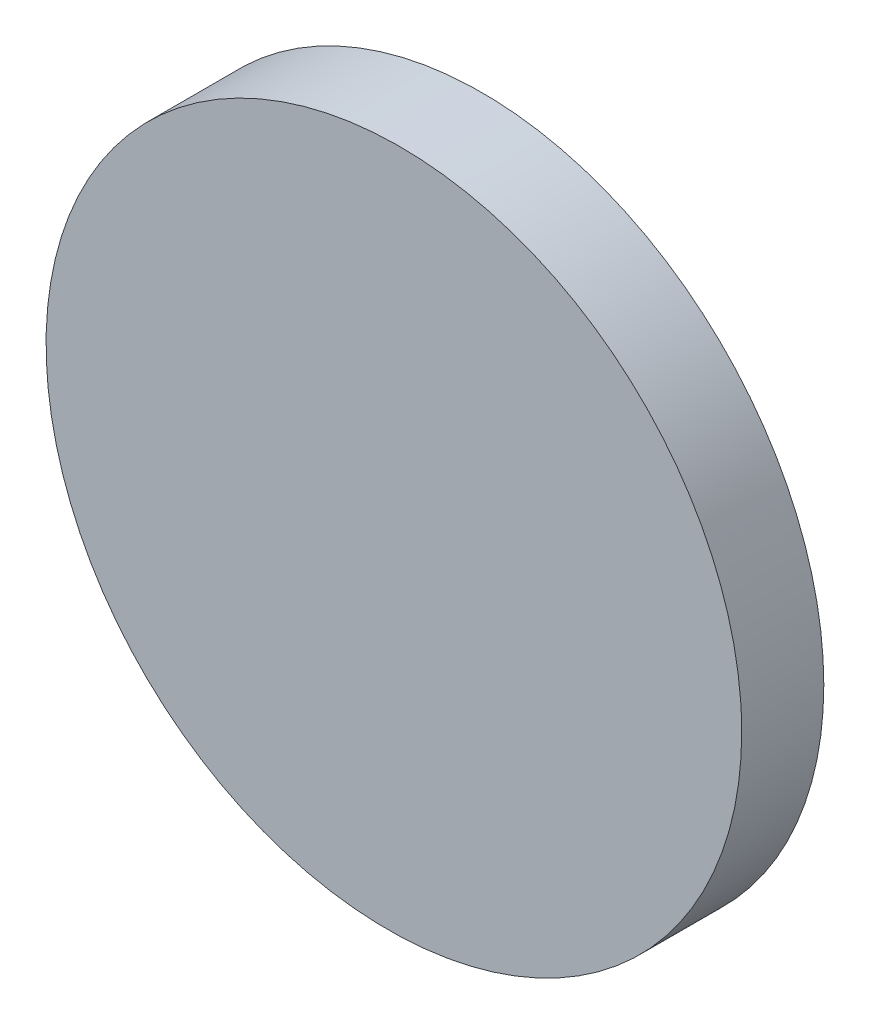
ISO-10303-21;
HEADER;
FILE_DESCRIPTION(('STEP AP214'),'2;1');
FILE_NAME('part.step','',(''),(''),'','','');
FILE_SCHEMA(('AUTOMOTIVE_DESIGN { 1 0 10303 214 1 1 1 1 }'));
ENDSEC;
DATA;
#1=APPLICATION_CONTEXT('core data for automotive mechanical design processes');
#2=APPLICATION_PROTOCOL_DEFINITION('international standard','automotive_design',2000,#1);
#3=PRODUCT_CONTEXT('',#1,'mechanical');
#4=PRODUCT('Part','Part','',(#3));
#5=PRODUCT_RELATED_PRODUCT_CATEGORY('part','',(#4));
#6=PRODUCT_DEFINITION_FORMATION('','',#4);
#7=PRODUCT_DEFINITION_CONTEXT('part definition',#1,'design');
#8=PRODUCT_DEFINITION('design','',#6,#7);
#9=PRODUCT_DEFINITION_SHAPE('','',#8);
#10=(LENGTH_UNIT() NAMED_UNIT(*) SI_UNIT(.MILLI.,.METRE.));
#11=(NAMED_UNIT(*) PLANE_ANGLE_UNIT() SI_UNIT($,.RADIAN.));
#12=(NAMED_UNIT(*) SI_UNIT($,.STERADIAN.) SOLID_ANGLE_UNIT());
#13=UNCERTAINTY_MEASURE_WITH_UNIT(LENGTH_MEASURE(1.E-05),#10,'distance_accuracy_value','');
#14=(GEOMETRIC_REPRESENTATION_CONTEXT(3) GLOBAL_UNCERTAINTY_ASSIGNED_CONTEXT((#13)) GLOBAL_UNIT_ASSIGNED_CONTEXT((#10,
#11,#12)) REPRESENTATION_CONTEXT('',''));
#15=CARTESIAN_POINT('',(0.,0.,0.));
#16=DIRECTION('',(0.,0.,1.));
#17=DIRECTION('',(1.,0.,0.));
#18=AXIS2_PLACEMENT_3D('',#15,#16,#17);
#19=CARTESIAN_POINT('',(0.,0.,10.));
#20=DIRECTION('',(0.,0.,-1.));
#21=DIRECTION('',(-1.,0.,0.));
#22=AXIS2_PLACEMENT_3D('',#19,#20,#21);
#23=CYLINDRICAL_SURFACE('',#22,12.5);
#24=CARTESIAN_POINT('',(0.,0.,3.2116413920234));
#25=DIRECTION('',(-0.0169288850398978,0.,-0.999856696157657));
#26=DIRECTION('',(0.999856696157657,0.,-0.0169288850398978));
#27=AXIS2_PLACEMENT_3D('',#24,#25,#26);
#28=ELLIPSE('',#27,12.501791554766,12.5);
#29=CARTESIAN_POINT('',(12.5,0.,3.));
#30=VERTEX_POINT('',#29);
#31=EDGE_CURVE('E36',#30,#30,#28,.T.);
#32=ORIENTED_EDGE('',*,*,#31,.T.);
#33=EDGE_LOOP('',(#32));
#34=FACE_BOUND('',#33,.T.);
#35=CARTESIAN_POINT('',(0.,0.,0.));
#36=DIRECTION('',(0.,0.,1.));
#37=DIRECTION('',(1.,0.,0.));
#38=AXIS2_PLACEMENT_3D('',#35,#36,#37);
#39=CIRCLE('',#38,12.5);
#40=CARTESIAN_POINT('',(12.5,0.,0.));
#41=VERTEX_POINT('',#40);
#42=EDGE_CURVE('E10',#41,#41,#39,.T.);
#43=ORIENTED_EDGE('',*,*,#42,.T.);
#44=EDGE_LOOP('',(#43));
#45=FACE_BOUND('',#44,.T.);
#46=ADVANCED_FACE('F33',(#34,#45),#23,.T.);
#47=CARTESIAN_POINT('',(0.,0.,0.));
#48=DIRECTION('',(0.,0.,1.));
#49=DIRECTION('',(1.,0.,0.));
#50=AXIS2_PLACEMENT_3D('',#47,#48,#49);
#51=PLANE('',#50);
#52=ORIENTED_EDGE('',*,*,#42,.F.);
#53=EDGE_LOOP('',(#52));
#54=FACE_BOUND('',#53,.T.);
#55=ADVANCED_FACE('F48',(#54),#51,.F.);
#56=CARTESIAN_POINT('',(12.5,-25.,3.));
#57=DIRECTION('',(-0.0169288850398978,0.,-0.999856696157657));
#58=DIRECTION('',(-0.999856696157657,0.,0.0169288850398978));
#59=AXIS2_PLACEMENT_3D('',#56,#57,#58);
#60=PLANE('',#59);
#61=ORIENTED_EDGE('',*,*,#31,.F.);
#62=EDGE_LOOP('',(#61));
#63=FACE_BOUND('',#62,.T.);
#64=ADVANCED_FACE('F46',(#63),#60,.F.);
#65=CLOSED_SHELL('',(#46,#55,#64));
#66=MANIFOLD_SOLID_BREP('B2',#65);
#67=ADVANCED_BREP_SHAPE_REPRESENTATION('',(#18,#66),#14);
#68=SHAPE_DEFINITION_REPRESENTATION(#9,#67);
ENDSEC;
END-ISO-10303-21;
